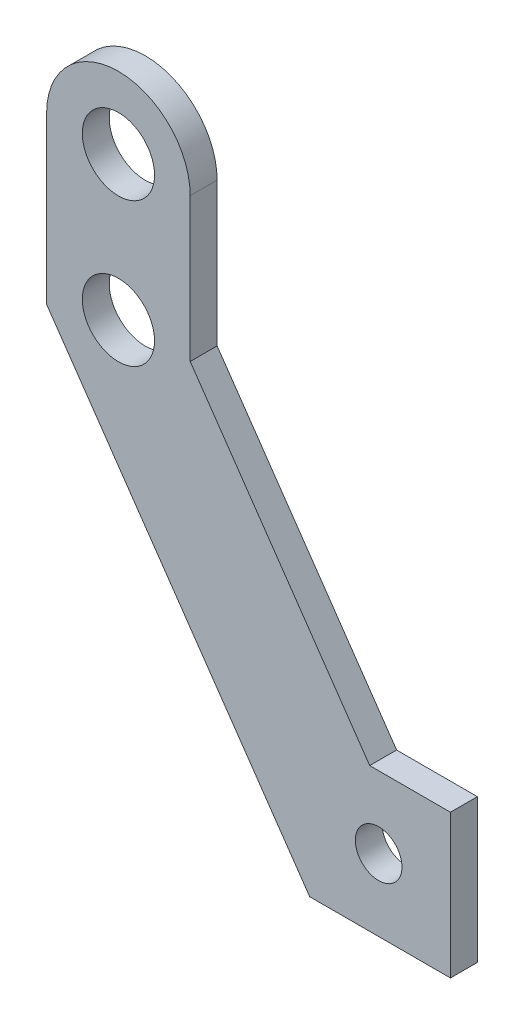
ISO-10303-21;
HEADER;
FILE_DESCRIPTION(('STEP AP214'),'2;1');
FILE_NAME('part.step','',(''),(''),'','','');
FILE_SCHEMA(('AUTOMOTIVE_DESIGN { 1 0 10303 214 1 1 1 1 }'));
ENDSEC;
DATA;
#1=APPLICATION_CONTEXT('core data for automotive mechanical design processes');
#2=APPLICATION_PROTOCOL_DEFINITION('international standard','automotive_design',2000,#1);
#3=PRODUCT_CONTEXT('',#1,'mechanical');
#4=PRODUCT('Part','Part','',(#3));
#5=PRODUCT_RELATED_PRODUCT_CATEGORY('part','',(#4));
#6=PRODUCT_DEFINITION_FORMATION('','',#4);
#7=PRODUCT_DEFINITION_CONTEXT('part definition',#1,'design');
#8=PRODUCT_DEFINITION('design','',#6,#7);
#9=PRODUCT_DEFINITION_SHAPE('','',#8);
#10=(LENGTH_UNIT() NAMED_UNIT(*) SI_UNIT(.MILLI.,.METRE.));
#11=(NAMED_UNIT(*) PLANE_ANGLE_UNIT() SI_UNIT($,.RADIAN.));
#12=(NAMED_UNIT(*) SI_UNIT($,.STERADIAN.) SOLID_ANGLE_UNIT());
#13=UNCERTAINTY_MEASURE_WITH_UNIT(LENGTH_MEASURE(1.E-05),#10,'distance_accuracy_value','');
#14=(GEOMETRIC_REPRESENTATION_CONTEXT(3) GLOBAL_UNCERTAINTY_ASSIGNED_CONTEXT((#13)) GLOBAL_UNIT_ASSIGNED_CONTEXT((#10,
#11,#12)) REPRESENTATION_CONTEXT('',''));
#15=CARTESIAN_POINT('',(0.,0.,0.));
#16=DIRECTION('',(0.,0.,1.));
#17=DIRECTION('',(1.,0.,0.));
#18=AXIS2_PLACEMENT_3D('',#15,#16,#17);
#19=CARTESIAN_POINT('',(8.,46.,13.));
#20=DIRECTION('',(0.,0.,1.));
#21=DIRECTION('',(1.,0.,0.));
#22=AXIS2_PLACEMENT_3D('',#19,#20,#21);
#23=PLANE('',#22);
#24=CARTESIAN_POINT('',(8.,46.,13.));
#25=DIRECTION('',(0.,0.,1.));
#26=DIRECTION('',(1.,0.,0.));
#27=AXIS2_PLACEMENT_3D('',#24,#25,#26);
#28=CIRCLE('',#27,4.025);
#29=CARTESIAN_POINT('',(12.025,46.,13.));
#30=VERTEX_POINT('',#29);
#31=EDGE_CURVE('E240',#30,#30,#28,.T.);
#32=ORIENTED_EDGE('',*,*,#31,.F.);
#33=EDGE_LOOP('',(#32));
#34=FACE_BOUND('',#33,.T.);
#35=DIRECTION('',(0.,-1.,0.));
#36=VECTOR('',#35,1.);
#37=CARTESIAN_POINT('',(45.,30.,13.));
#38=LINE('',#37,#36);
#39=CARTESIAN_POINT('',(45.,1.,13.));
#40=VERTEX_POINT('',#39);
#41=CARTESIAN_POINT('',(45.,-15.,13.));
#42=VERTEX_POINT('',#41);
#43=EDGE_CURVE('E177',#40,#42,#38,.T.);
#44=ORIENTED_EDGE('',*,*,#43,.F.);
#45=DIRECTION('',(1.,0.,0.));
#46=VECTOR('',#45,1.);
#47=CARTESIAN_POINT('',(8.,0.999999999999997,13.));
#48=LINE('',#47,#46);
#49=CARTESIAN_POINT('',(36.,1.,13.));
#50=VERTEX_POINT('',#49);
#51=EDGE_CURVE('E133',#50,#40,#48,.T.);
#52=ORIENTED_EDGE('',*,*,#51,.F.);
#53=DIRECTION('',(0.56773295580366,-0.823212785915306,0.));
#54=VECTOR('',#53,1.);
#55=CARTESIAN_POINT('',(13.4214343271555,33.7389202256245,13.));
#56=LINE('',#55,#54);
#57=CARTESIAN_POINT('',(16.,30.,13.));
#58=VERTEX_POINT('',#57);
#59=EDGE_CURVE('E119',#58,#50,#56,.T.);
#60=ORIENTED_EDGE('',*,*,#59,.F.);
#61=DIRECTION('',(0.,-1.,0.));
#62=VECTOR('',#61,1.);
#63=CARTESIAN_POINT('',(16.,30.,13.));
#64=LINE('',#63,#62);
#65=CARTESIAN_POINT('',(16.,46.,13.));
#66=VERTEX_POINT('',#65);
#67=EDGE_CURVE('E132',#66,#58,#64,.T.);
#68=ORIENTED_EDGE('',*,*,#67,.F.);
#69=CARTESIAN_POINT('',(8.,46.,13.));
#70=DIRECTION('',(0.,0.,1.));
#71=DIRECTION('',(1.,0.,0.));
#72=AXIS2_PLACEMENT_3D('',#69,#70,#71);
#73=CIRCLE('',#72,8.);
#74=CARTESIAN_POINT('',(0.,46.,13.));
#75=VERTEX_POINT('',#74);
#76=EDGE_CURVE('E139',#66,#75,#73,.T.);
#77=ORIENTED_EDGE('',*,*,#76,.T.);
#78=DIRECTION('',(0.,1.,0.));
#79=VECTOR('',#78,1.);
#80=CARTESIAN_POINT('',(0.,30.,13.));
#81=LINE('',#80,#79);
#82=CARTESIAN_POINT('',(0.,27.5088680369532,13.));
#83=VERTEX_POINT('',#82);
#84=EDGE_CURVE('E143',#83,#75,#81,.T.);
#85=ORIENTED_EDGE('',*,*,#84,.F.);
#86=DIRECTION('',(-0.56773295580366,0.823212785915306,0.));
#87=VECTOR('',#86,1.);
#88=CARTESIAN_POINT('',(1.41429771267754,25.4581363535707,13.));
#89=LINE('',#88,#87);
#90=CARTESIAN_POINT('',(29.3164607151401,-15.,13.));
#91=VERTEX_POINT('',#90);
#92=EDGE_CURVE('E259',#91,#83,#89,.T.);
#93=ORIENTED_EDGE('',*,*,#92,.F.);
#94=DIRECTION('',(-1.,0.,0.));
#95=VECTOR('',#94,1.);
#96=CARTESIAN_POINT('',(7.99999999999999,-15.,13.));
#97=LINE('',#96,#95);
#98=EDGE_CURVE('E256',#42,#91,#97,.T.);
#99=ORIENTED_EDGE('',*,*,#98,.F.);
#100=EDGE_LOOP('',(#44,#52,#60,#68,#77,#85,#93,#99));
#101=FACE_BOUND('',#100,.T.);
#102=CARTESIAN_POINT('',(7.99999999999999,30.,13.));
#103=DIRECTION('',(0.,0.,1.));
#104=DIRECTION('',(1.,0.,0.));
#105=AXIS2_PLACEMENT_3D('',#102,#103,#104);
#106=CIRCLE('',#105,4.025);
#107=CARTESIAN_POINT('',(12.025,30.,13.));
#108=VERTEX_POINT('',#107);
#109=EDGE_CURVE('E154',#108,#108,#106,.T.);
#110=ORIENTED_EDGE('',*,*,#109,.F.);
#111=EDGE_LOOP('',(#110));
#112=FACE_BOUND('',#111,.T.);
#113=CARTESIAN_POINT('',(37.,-7.,13.));
#114=DIRECTION('',(0.,0.,1.));
#115=DIRECTION('',(1.,0.,0.));
#116=AXIS2_PLACEMENT_3D('',#113,#114,#115);
#117=CIRCLE('',#116,2.6);
#118=CARTESIAN_POINT('',(39.6,-7.,13.));
#119=VERTEX_POINT('',#118);
#120=EDGE_CURVE('E229',#119,#119,#117,.T.);
#121=ORIENTED_EDGE('',*,*,#120,.F.);
#122=EDGE_LOOP('',(#121));
#123=FACE_BOUND('',#122,.T.);
#124=ADVANCED_FACE('F45',(#34,#101,#112,#123),#23,.T.);
#125=CARTESIAN_POINT('',(8.,46.,10.));
#126=DIRECTION('',(0.,0.,1.));
#127=DIRECTION('',(1.,0.,0.));
#128=AXIS2_PLACEMENT_3D('',#125,#126,#127);
#129=PLANE('',#128);
#130=DIRECTION('',(0.,-1.,0.));
#131=VECTOR('',#130,1.);
#132=CARTESIAN_POINT('',(45.,30.,10.));
#133=LINE('',#132,#131);
#134=CARTESIAN_POINT('',(45.,1.,10.));
#135=VERTEX_POINT('',#134);
#136=CARTESIAN_POINT('',(45.,-15.,10.));
#137=VERTEX_POINT('',#136);
#138=EDGE_CURVE('E149',#135,#137,#133,.T.);
#139=ORIENTED_EDGE('',*,*,#138,.T.);
#140=DIRECTION('',(-1.,0.,0.));
#141=VECTOR('',#140,1.);
#142=CARTESIAN_POINT('',(7.99999999999999,-15.,10.));
#143=LINE('',#142,#141);
#144=CARTESIAN_POINT('',(29.3164607151401,-15.,10.));
#145=VERTEX_POINT('',#144);
#146=EDGE_CURVE('E153',#137,#145,#143,.T.);
#147=ORIENTED_EDGE('',*,*,#146,.T.);
#148=DIRECTION('',(-0.56773295580366,0.823212785915306,0.));
#149=VECTOR('',#148,1.);
#150=CARTESIAN_POINT('',(1.41429771267754,25.4581363535707,10.));
#151=LINE('',#150,#149);
#152=CARTESIAN_POINT('',(0.,27.5088680369532,10.));
#153=VERTEX_POINT('',#152);
#154=EDGE_CURVE('E158',#145,#153,#151,.T.);
#155=ORIENTED_EDGE('',*,*,#154,.T.);
#156=DIRECTION('',(0.,1.,0.));
#157=VECTOR('',#156,1.);
#158=CARTESIAN_POINT('',(0.,30.,10.));
#159=LINE('',#158,#157);
#160=CARTESIAN_POINT('',(0.,46.,10.));
#161=VERTEX_POINT('',#160);
#162=EDGE_CURVE('E161',#153,#161,#159,.T.);
#163=ORIENTED_EDGE('',*,*,#162,.T.);
#164=CARTESIAN_POINT('',(8.,46.,10.));
#165=DIRECTION('',(0.,0.,1.));
#166=DIRECTION('',(1.,0.,0.));
#167=AXIS2_PLACEMENT_3D('',#164,#165,#166);
#168=CIRCLE('',#167,8.);
#169=CARTESIAN_POINT('',(16.,46.,10.));
#170=VERTEX_POINT('',#169);
#171=EDGE_CURVE('E165',#170,#161,#168,.T.);
#172=ORIENTED_EDGE('',*,*,#171,.F.);
#173=DIRECTION('',(0.,-1.,0.));
#174=VECTOR('',#173,1.);
#175=CARTESIAN_POINT('',(16.,30.,10.));
#176=LINE('',#175,#174);
#177=CARTESIAN_POINT('',(16.,30.,10.));
#178=VERTEX_POINT('',#177);
#179=EDGE_CURVE('E169',#170,#178,#176,.T.);
#180=ORIENTED_EDGE('',*,*,#179,.T.);
#181=DIRECTION('',(0.56773295580366,-0.823212785915306,0.));
#182=VECTOR('',#181,1.);
#183=CARTESIAN_POINT('',(13.4214343271555,33.7389202256245,10.));
#184=LINE('',#183,#182);
#185=CARTESIAN_POINT('',(36.,1.,10.));
#186=VERTEX_POINT('',#185);
#187=EDGE_CURVE('E121',#178,#186,#184,.T.);
#188=ORIENTED_EDGE('',*,*,#187,.T.);
#189=DIRECTION('',(1.,0.,0.));
#190=VECTOR('',#189,1.);
#191=CARTESIAN_POINT('',(8.,0.999999999999997,10.));
#192=LINE('',#191,#190);
#193=EDGE_CURVE('E174',#186,#135,#192,.T.);
#194=ORIENTED_EDGE('',*,*,#193,.T.);
#195=EDGE_LOOP('',(#139,#147,#155,#163,#172,#180,#188,#194));
#196=FACE_BOUND('',#195,.T.);
#197=CARTESIAN_POINT('',(7.99999999999999,30.,10.));
#198=DIRECTION('',(0.,0.,1.));
#199=DIRECTION('',(1.,0.,0.));
#200=AXIS2_PLACEMENT_3D('',#197,#198,#199);
#201=CIRCLE('',#200,4.025);
#202=CARTESIAN_POINT('',(12.025,30.,10.));
#203=VERTEX_POINT('',#202);
#204=EDGE_CURVE('E244',#203,#203,#201,.T.);
#205=ORIENTED_EDGE('',*,*,#204,.T.);
#206=EDGE_LOOP('',(#205));
#207=FACE_BOUND('',#206,.T.);
#208=CARTESIAN_POINT('',(8.,46.,10.));
#209=DIRECTION('',(0.,0.,1.));
#210=DIRECTION('',(1.,0.,0.));
#211=AXIS2_PLACEMENT_3D('',#208,#209,#210);
#212=CIRCLE('',#211,4.025);
#213=CARTESIAN_POINT('',(12.025,46.,10.));
#214=VERTEX_POINT('',#213);
#215=EDGE_CURVE('E237',#214,#214,#212,.T.);
#216=ORIENTED_EDGE('',*,*,#215,.T.);
#217=EDGE_LOOP('',(#216));
#218=FACE_BOUND('',#217,.T.);
#219=CARTESIAN_POINT('',(37.,-7.,10.));
#220=DIRECTION('',(0.,0.,1.));
#221=DIRECTION('',(1.,0.,0.));
#222=AXIS2_PLACEMENT_3D('',#219,#220,#221);
#223=CIRCLE('',#222,2.6);
#224=CARTESIAN_POINT('',(39.6,-7.,10.));
#225=VERTEX_POINT('',#224);
#226=EDGE_CURVE('E232',#225,#225,#223,.T.);
#227=ORIENTED_EDGE('',*,*,#226,.T.);
#228=EDGE_LOOP('',(#227));
#229=FACE_BOUND('',#228,.T.);
#230=ADVANCED_FACE('F194',(#196,#207,#218,#229),#129,.F.);
#231=CARTESIAN_POINT('',(45.,30.,13.));
#232=DIRECTION('',(1.,0.,0.));
#233=DIRECTION('',(0.,0.,-1.));
#234=AXIS2_PLACEMENT_3D('',#231,#232,#233);
#235=PLANE('',#234);
#236=ORIENTED_EDGE('',*,*,#138,.F.);
#237=DIRECTION('',(0.,0.,-1.));
#238=VECTOR('',#237,1.);
#239=CARTESIAN_POINT('',(45.,1.,13.));
#240=LINE('',#239,#238);
#241=EDGE_CURVE('E11',#40,#135,#240,.T.);
#242=ORIENTED_EDGE('',*,*,#241,.F.);
#243=ORIENTED_EDGE('',*,*,#43,.T.);
#244=DIRECTION('',(0.,0.,-1.));
#245=VECTOR('',#244,1.);
#246=CARTESIAN_POINT('',(45.,-15.,13.));
#247=LINE('',#246,#245);
#248=EDGE_CURVE('E49',#42,#137,#247,.T.);
#249=ORIENTED_EDGE('',*,*,#248,.T.);
#250=EDGE_LOOP('',(#236,#242,#243,#249));
#251=FACE_BOUND('',#250,.T.);
#252=ADVANCED_FACE('F47',(#251),#235,.T.);
#253=CARTESIAN_POINT('',(8.,0.999999999999997,13.));
#254=DIRECTION('',(0.,1.,0.));
#255=DIRECTION('',(-1.,0.,0.));
#256=AXIS2_PLACEMENT_3D('',#253,#254,#255);
#257=PLANE('',#256);
#258=ORIENTED_EDGE('',*,*,#193,.F.);
#259=DIRECTION('',(0.,0.,-1.));
#260=VECTOR('',#259,1.);
#261=CARTESIAN_POINT('',(36.,1.,13.));
#262=LINE('',#261,#260);
#263=EDGE_CURVE('E56',#50,#186,#262,.T.);
#264=ORIENTED_EDGE('',*,*,#263,.F.);
#265=ORIENTED_EDGE('',*,*,#51,.T.);
#266=ORIENTED_EDGE('',*,*,#241,.T.);
#267=EDGE_LOOP('',(#258,#264,#265,#266));
#268=FACE_BOUND('',#267,.T.);
#269=ADVANCED_FACE('F196',(#268),#257,.T.);
#270=CARTESIAN_POINT('',(13.4214343271555,33.7389202256245,13.));
#271=DIRECTION('',(0.823212785915306,0.56773295580366,0.));
#272=DIRECTION('',(-0.56773295580366,0.823212785915306,0.));
#273=AXIS2_PLACEMENT_3D('',#270,#271,#272);
#274=PLANE('',#273);
#275=ORIENTED_EDGE('',*,*,#187,.F.);
#276=DIRECTION('',(0.,0.,-1.));
#277=VECTOR('',#276,1.);
#278=CARTESIAN_POINT('',(16.,30.,13.));
#279=LINE('',#278,#277);
#280=EDGE_CURVE('E116',#58,#178,#279,.T.);
#281=ORIENTED_EDGE('',*,*,#280,.F.);
#282=ORIENTED_EDGE('',*,*,#59,.T.);
#283=ORIENTED_EDGE('',*,*,#263,.T.);
#284=EDGE_LOOP('',(#275,#281,#282,#283));
#285=FACE_BOUND('',#284,.T.);
#286=ADVANCED_FACE('F118',(#285),#274,.T.);
#287=CARTESIAN_POINT('',(16.,30.,13.));
#288=DIRECTION('',(1.,0.,0.));
#289=DIRECTION('',(0.,0.,-1.));
#290=AXIS2_PLACEMENT_3D('',#287,#288,#289);
#291=PLANE('',#290);
#292=ORIENTED_EDGE('',*,*,#179,.F.);
#293=DIRECTION('',(0.,0.,-1.));
#294=VECTOR('',#293,1.);
#295=CARTESIAN_POINT('',(16.,46.,13.));
#296=LINE('',#295,#294);
#297=EDGE_CURVE('E127',#66,#170,#296,.T.);
#298=ORIENTED_EDGE('',*,*,#297,.F.);
#299=ORIENTED_EDGE('',*,*,#67,.T.);
#300=ORIENTED_EDGE('',*,*,#280,.T.);
#301=EDGE_LOOP('',(#292,#298,#299,#300));
#302=FACE_BOUND('',#301,.T.);
#303=ADVANCED_FACE('F136',(#302),#291,.T.);
#304=CARTESIAN_POINT('',(8.,46.,13.));
#305=DIRECTION('',(0.,0.,-1.));
#306=DIRECTION('',(-1.,0.,0.));
#307=AXIS2_PLACEMENT_3D('',#304,#305,#306);
#308=CYLINDRICAL_SURFACE('',#307,8.);
#309=ORIENTED_EDGE('',*,*,#171,.T.);
#310=DIRECTION('',(0.,0.,-1.));
#311=VECTOR('',#310,1.);
#312=CARTESIAN_POINT('',(0.,46.,13.));
#313=LINE('',#312,#311);
#314=EDGE_CURVE('E183',#75,#161,#313,.T.);
#315=ORIENTED_EDGE('',*,*,#314,.F.);
#316=ORIENTED_EDGE('',*,*,#76,.F.);
#317=ORIENTED_EDGE('',*,*,#297,.T.);
#318=EDGE_LOOP('',(#309,#315,#316,#317));
#319=FACE_BOUND('',#318,.T.);
#320=ADVANCED_FACE('F274',(#319),#308,.T.);
#321=CARTESIAN_POINT('',(0.,30.,13.));
#322=DIRECTION('',(-1.,0.,0.));
#323=DIRECTION('',(0.,-1.,0.));
#324=AXIS2_PLACEMENT_3D('',#321,#322,#323);
#325=PLANE('',#324);
#326=ORIENTED_EDGE('',*,*,#162,.F.);
#327=DIRECTION('',(0.,0.,-1.));
#328=VECTOR('',#327,1.);
#329=CARTESIAN_POINT('',(0.,27.5088680369532,13.));
#330=LINE('',#329,#328);
#331=EDGE_CURVE('E186',#83,#153,#330,.T.);
#332=ORIENTED_EDGE('',*,*,#331,.F.);
#333=ORIENTED_EDGE('',*,*,#84,.T.);
#334=ORIENTED_EDGE('',*,*,#314,.T.);
#335=EDGE_LOOP('',(#326,#332,#333,#334));
#336=FACE_BOUND('',#335,.T.);
#337=ADVANCED_FACE('F267',(#336),#325,.T.);
#338=CARTESIAN_POINT('',(1.41429771267754,25.4581363535707,13.));
#339=DIRECTION('',(-0.823212785915306,-0.56773295580366,0.));
#340=DIRECTION('',(0.56773295580366,-0.823212785915306,0.));
#341=AXIS2_PLACEMENT_3D('',#338,#339,#340);
#342=PLANE('',#341);
#343=ORIENTED_EDGE('',*,*,#154,.F.);
#344=DIRECTION('',(0.,0.,-1.));
#345=VECTOR('',#344,1.);
#346=CARTESIAN_POINT('',(29.3164607151401,-15.,13.));
#347=LINE('',#346,#345);
#348=EDGE_CURVE('E188',#91,#145,#347,.T.);
#349=ORIENTED_EDGE('',*,*,#348,.F.);
#350=ORIENTED_EDGE('',*,*,#92,.T.);
#351=ORIENTED_EDGE('',*,*,#331,.T.);
#352=EDGE_LOOP('',(#343,#349,#350,#351));
#353=FACE_BOUND('',#352,.T.);
#354=ADVANCED_FACE('F271',(#353),#342,.T.);
#355=CARTESIAN_POINT('',(7.99999999999999,-15.,13.));
#356=DIRECTION('',(0.,-1.,0.));
#357=DIRECTION('',(0.,0.,-1.));
#358=AXIS2_PLACEMENT_3D('',#355,#356,#357);
#359=PLANE('',#358);
#360=ORIENTED_EDGE('',*,*,#146,.F.);
#361=ORIENTED_EDGE('',*,*,#248,.F.);
#362=ORIENTED_EDGE('',*,*,#98,.T.);
#363=ORIENTED_EDGE('',*,*,#348,.T.);
#364=EDGE_LOOP('',(#360,#361,#362,#363));
#365=FACE_BOUND('',#364,.T.);
#366=ADVANCED_FACE('F192',(#365),#359,.T.);
#367=CARTESIAN_POINT('',(7.99999999999999,30.,13.));
#368=DIRECTION('',(0.,0.,-1.));
#369=DIRECTION('',(-1.,0.,0.));
#370=AXIS2_PLACEMENT_3D('',#367,#368,#369);
#371=CYLINDRICAL_SURFACE('',#370,4.025);
#372=ORIENTED_EDGE('',*,*,#109,.T.);
#373=EDGE_LOOP('',(#372));
#374=FACE_BOUND('',#373,.T.);
#375=ORIENTED_EDGE('',*,*,#204,.F.);
#376=EDGE_LOOP('',(#375));
#377=FACE_BOUND('',#376,.T.);
#378=ADVANCED_FACE('F213',(#374,#377),#371,.F.);
#379=CARTESIAN_POINT('',(8.,46.,13.));
#380=DIRECTION('',(0.,0.,-1.));
#381=DIRECTION('',(-1.,0.,0.));
#382=AXIS2_PLACEMENT_3D('',#379,#380,#381);
#383=CYLINDRICAL_SURFACE('',#382,4.025);
#384=ORIENTED_EDGE('',*,*,#31,.T.);
#385=EDGE_LOOP('',(#384));
#386=FACE_BOUND('',#385,.T.);
#387=ORIENTED_EDGE('',*,*,#215,.F.);
#388=EDGE_LOOP('',(#387));
#389=FACE_BOUND('',#388,.T.);
#390=ADVANCED_FACE('F216',(#386,#389),#383,.F.);
#391=CARTESIAN_POINT('',(37.,-7.,13.));
#392=DIRECTION('',(0.,0.,-1.));
#393=DIRECTION('',(-1.,0.,0.));
#394=AXIS2_PLACEMENT_3D('',#391,#392,#393);
#395=CYLINDRICAL_SURFACE('',#394,2.6);
#396=ORIENTED_EDGE('',*,*,#120,.T.);
#397=EDGE_LOOP('',(#396));
#398=FACE_BOUND('',#397,.T.);
#399=ORIENTED_EDGE('',*,*,#226,.F.);
#400=EDGE_LOOP('',(#399));
#401=FACE_BOUND('',#400,.T.);
#402=ADVANCED_FACE('F220',(#398,#401),#395,.F.);
#403=CLOSED_SHELL('',(#124,#230,#252,#269,#286,#303,#320,#337,#354,#366,#378,#390,#402));
#404=MANIFOLD_SOLID_BREP('B2',#403);
#405=ADVANCED_BREP_SHAPE_REPRESENTATION('',(#18,#404),#14);
#406=SHAPE_DEFINITION_REPRESENTATION(#9,#405);
ENDSEC;
END-ISO-10303-21;
